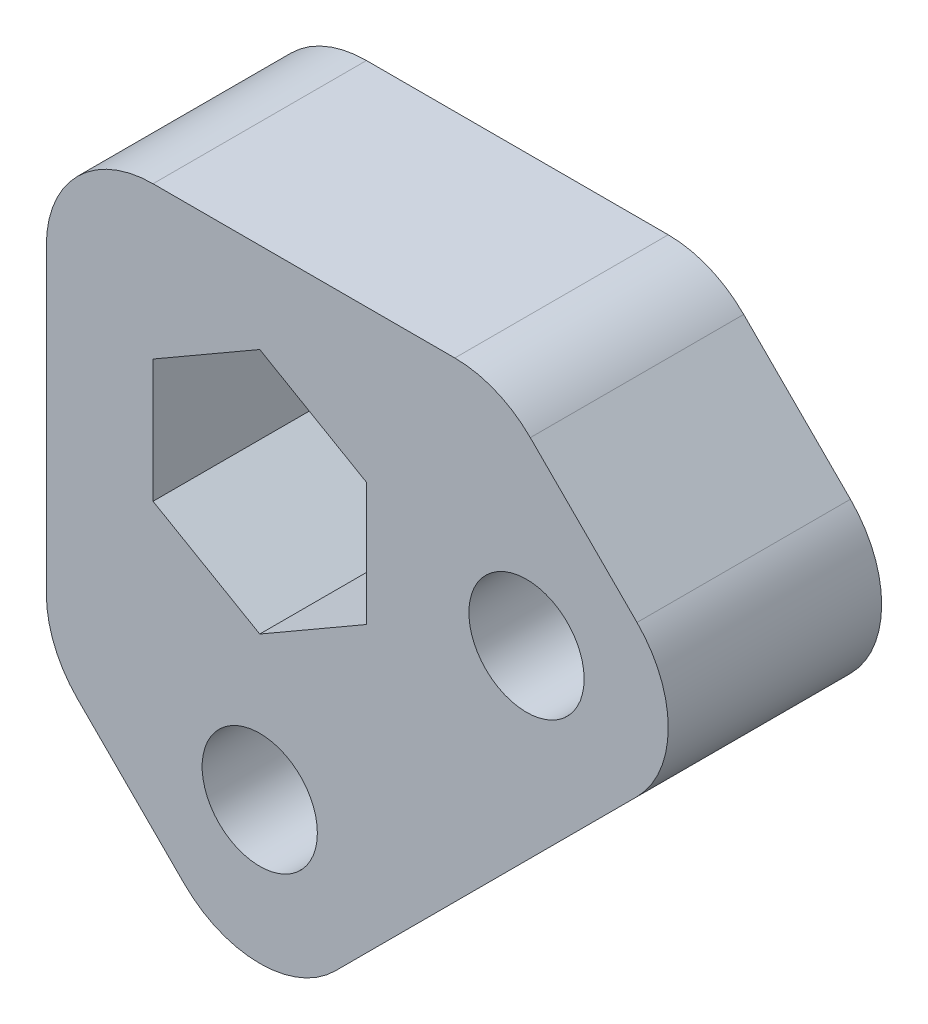
ISO-10303-21;
HEADER;
FILE_DESCRIPTION(('STEP AP214'),'2;1');
FILE_NAME('part.step','',(''),(''),'','','');
FILE_SCHEMA(('AUTOMOTIVE_DESIGN { 1 0 10303 214 1 1 1 1 }'));
ENDSEC;
DATA;
#1=APPLICATION_CONTEXT('core data for automotive mechanical design processes');
#2=APPLICATION_PROTOCOL_DEFINITION('international standard','automotive_design',2000,#1);
#3=PRODUCT_CONTEXT('',#1,'mechanical');
#4=PRODUCT('Part','Part','',(#3));
#5=PRODUCT_RELATED_PRODUCT_CATEGORY('part','',(#4));
#6=PRODUCT_DEFINITION_FORMATION('','',#4);
#7=PRODUCT_DEFINITION_CONTEXT('part definition',#1,'design');
#8=PRODUCT_DEFINITION('design','',#6,#7);
#9=PRODUCT_DEFINITION_SHAPE('','',#8);
#10=(LENGTH_UNIT() NAMED_UNIT(*) SI_UNIT(.MILLI.,.METRE.));
#11=(NAMED_UNIT(*) PLANE_ANGLE_UNIT() SI_UNIT($,.RADIAN.));
#12=(NAMED_UNIT(*) SI_UNIT($,.STERADIAN.) SOLID_ANGLE_UNIT());
#13=UNCERTAINTY_MEASURE_WITH_UNIT(LENGTH_MEASURE(1.E-05),#10,'distance_accuracy_value','');
#14=(GEOMETRIC_REPRESENTATION_CONTEXT(3) GLOBAL_UNCERTAINTY_ASSIGNED_CONTEXT((#13)) GLOBAL_UNIT_ASSIGNED_CONTEXT((#10,
#11,#12)) REPRESENTATION_CONTEXT('',''));
#15=CARTESIAN_POINT('',(0.,0.,0.));
#16=DIRECTION('',(0.,0.,1.));
#17=DIRECTION('',(1.,0.,0.));
#18=AXIS2_PLACEMENT_3D('',#15,#16,#17);
#19=CARTESIAN_POINT('',(-6.35,-11.6105122421383,12.7));
#20=DIRECTION('',(0.,0.,1.));
#21=DIRECTION('',(1.,0.,0.));
#22=AXIS2_PLACEMENT_3D('',#19,#20,#21);
#23=PLANE('',#22);
#24=CARTESIAN_POINT('',(15.8750000000004,0.,12.7));
#25=DIRECTION('',(0.,0.,1.));
#26=DIRECTION('',(1.,0.,0.));
#27=AXIS2_PLACEMENT_3D('',#24,#25,#26);
#28=CIRCLE('',#27,3.429);
#29=CARTESIAN_POINT('',(19.3040000000004,0.,12.7));
#30=VERTEX_POINT('',#29);
#31=EDGE_CURVE('E201',#30,#30,#28,.T.);
#32=ORIENTED_EDGE('',*,*,#31,.F.);
#33=EDGE_LOOP('',(#32));
#34=FACE_BOUND('',#33,.T.);
#35=CARTESIAN_POINT('',(-6.35,-11.6105122421383,12.7));
#36=DIRECTION('',(0.,0.,1.));
#37=DIRECTION('',(1.,0.,0.));
#38=AXIS2_PLACEMENT_3D('',#35,#36,#37);
#39=CIRCLE('',#38,6.35);
#40=CARTESIAN_POINT('',(-12.7,-11.6105122421383,12.7));
#41=VERTEX_POINT('',#40);
#42=CARTESIAN_POINT('',(-10.8401280605346,-16.1006403026729,12.7));
#43=VERTEX_POINT('',#42);
#44=EDGE_CURVE('E231',#41,#43,#39,.T.);
#45=ORIENTED_EDGE('',*,*,#44,.T.);
#46=DIRECTION('',(0.707106781186547,-0.707106781186549,0.));
#47=VECTOR('',#46,1.);
#48=CARTESIAN_POINT('',(-10.8401280605346,-16.1006403026729,12.7));
#49=LINE('',#48,#47);
#50=CARTESIAN_POINT('',(-4.49012806053461,-22.4506403026729,12.7));
#51=VERTEX_POINT('',#50);
#52=EDGE_CURVE('E235',#43,#51,#49,.T.);
#53=ORIENTED_EDGE('',*,*,#52,.T.);
#54=CARTESIAN_POINT('',(0.,-17.9605122421383,12.7));
#55=DIRECTION('',(0.,0.,1.));
#56=DIRECTION('',(1.,0.,0.));
#57=AXIS2_PLACEMENT_3D('',#54,#55,#56);
#58=CIRCLE('',#57,6.35);
#59=CARTESIAN_POINT('',(4.49012806053461,-22.4506403026729,12.7));
#60=VERTEX_POINT('',#59);
#61=EDGE_CURVE('E239',#51,#60,#58,.T.);
#62=ORIENTED_EDGE('',*,*,#61,.T.);
#63=DIRECTION('',(0.707106781186547,0.707106781186547,0.));
#64=VECTOR('',#63,1.);
#65=CARTESIAN_POINT('',(4.49012806053461,-22.4506403026729,12.7));
#66=LINE('',#65,#64);
#67=CARTESIAN_POINT('',(22.4506403026729,-4.49012806053461,12.7));
#68=VERTEX_POINT('',#67);
#69=EDGE_CURVE('E242',#60,#68,#66,.T.);
#70=ORIENTED_EDGE('',*,*,#69,.T.);
#71=CARTESIAN_POINT('',(17.9605122421383,0.,12.7));
#72=DIRECTION('',(0.,0.,1.));
#73=DIRECTION('',(1.,0.,0.));
#74=AXIS2_PLACEMENT_3D('',#71,#72,#73);
#75=CIRCLE('',#74,6.35);
#76=CARTESIAN_POINT('',(22.4506403026729,4.49012806053461,12.7));
#77=VERTEX_POINT('',#76);
#78=EDGE_CURVE('E245',#68,#77,#75,.T.);
#79=ORIENTED_EDGE('',*,*,#78,.T.);
#80=DIRECTION('',(-0.707106781186548,0.707106781186547,0.));
#81=VECTOR('',#80,1.);
#82=CARTESIAN_POINT('',(22.4506403026729,4.49012806053461,12.7));
#83=LINE('',#82,#81);
#84=CARTESIAN_POINT('',(16.1006403026729,10.8401280605346,12.7));
#85=VERTEX_POINT('',#84);
#86=EDGE_CURVE('E248',#77,#85,#83,.T.);
#87=ORIENTED_EDGE('',*,*,#86,.T.);
#88=CARTESIAN_POINT('',(11.6105122421383,6.35,12.7));
#89=DIRECTION('',(0.,0.,1.));
#90=DIRECTION('',(-1.,0.,0.));
#91=AXIS2_PLACEMENT_3D('',#88,#89,#90);
#92=CIRCLE('',#91,6.35);
#93=CARTESIAN_POINT('',(11.6105122421383,12.7,12.7));
#94=VERTEX_POINT('',#93);
#95=EDGE_CURVE('E251',#85,#94,#92,.T.);
#96=ORIENTED_EDGE('',*,*,#95,.T.);
#97=DIRECTION('',(-1.,0.,0.));
#98=VECTOR('',#97,1.);
#99=CARTESIAN_POINT('',(-6.34999999999996,12.7,12.7));
#100=LINE('',#99,#98);
#101=CARTESIAN_POINT('',(-6.34999999999996,12.7,12.7));
#102=VERTEX_POINT('',#101);
#103=EDGE_CURVE('E254',#94,#102,#100,.T.);
#104=ORIENTED_EDGE('',*,*,#103,.T.);
#105=CARTESIAN_POINT('',(-6.35,6.35,12.7));
#106=DIRECTION('',(0.,0.,1.));
#107=DIRECTION('',(-1.,0.,0.));
#108=AXIS2_PLACEMENT_3D('',#105,#106,#107);
#109=CIRCLE('',#108,6.35);
#110=CARTESIAN_POINT('',(-12.7,6.34999999999995,12.7));
#111=VERTEX_POINT('',#110);
#112=EDGE_CURVE('E257',#102,#111,#109,.T.);
#113=ORIENTED_EDGE('',*,*,#112,.T.);
#114=DIRECTION('',(0.,-1.,0.));
#115=VECTOR('',#114,1.);
#116=CARTESIAN_POINT('',(-12.7,6.34999999999995,12.7));
#117=LINE('',#116,#115);
#118=EDGE_CURVE('E260',#111,#41,#117,.T.);
#119=ORIENTED_EDGE('',*,*,#118,.T.);
#120=EDGE_LOOP('',(#45,#53,#62,#70,#79,#87,#96,#104,#113,#119));
#121=FACE_BOUND('',#120,.T.);
#122=DIRECTION('',(-0.866025403784438,0.5,0.));
#123=VECTOR('',#122,1.);
#124=CARTESIAN_POINT('',(6.35,3.66617420935412,12.7));
#125=LINE('',#124,#123);
#126=CARTESIAN_POINT('',(6.35,3.66617420935412,12.7));
#127=VERTEX_POINT('',#126);
#128=CARTESIAN_POINT('',(0.,7.33234841870825,12.7));
#129=VERTEX_POINT('',#128);
#130=EDGE_CURVE('E168',#127,#129,#125,.T.);
#131=ORIENTED_EDGE('',*,*,#130,.F.);
#132=DIRECTION('',(0.,1.,0.));
#133=VECTOR('',#132,1.);
#134=CARTESIAN_POINT('',(6.35,-3.66617420935413,12.7));
#135=LINE('',#134,#133);
#136=CARTESIAN_POINT('',(6.35,-3.66617420935413,12.7));
#137=VERTEX_POINT('',#136);
#138=EDGE_CURVE('E159',#137,#127,#135,.T.);
#139=ORIENTED_EDGE('',*,*,#138,.F.);
#140=DIRECTION('',(0.866025403784439,0.5,0.));
#141=VECTOR('',#140,1.);
#142=CARTESIAN_POINT('',(0.,-7.33234841870825,12.7));
#143=LINE('',#142,#141);
#144=CARTESIAN_POINT('',(0.,-7.33234841870825,12.7));
#145=VERTEX_POINT('',#144);
#146=EDGE_CURVE('E196',#145,#137,#143,.T.);
#147=ORIENTED_EDGE('',*,*,#146,.F.);
#148=DIRECTION('',(0.866025403784439,-0.5,0.));
#149=VECTOR('',#148,1.);
#150=CARTESIAN_POINT('',(-6.35,-3.66617420935412,12.7));
#151=LINE('',#150,#149);
#152=CARTESIAN_POINT('',(-6.35,-3.66617420935412,12.7));
#153=VERTEX_POINT('',#152);
#154=EDGE_CURVE('E193',#153,#145,#151,.T.);
#155=ORIENTED_EDGE('',*,*,#154,.F.);
#156=DIRECTION('',(0.,-1.,0.));
#157=VECTOR('',#156,1.);
#158=CARTESIAN_POINT('',(-6.35,3.66617420935413,12.7));
#159=LINE('',#158,#157);
#160=CARTESIAN_POINT('',(-6.35,3.66617420935413,12.7));
#161=VERTEX_POINT('',#160);
#162=EDGE_CURVE('E187',#161,#153,#159,.T.);
#163=ORIENTED_EDGE('',*,*,#162,.F.);
#164=DIRECTION('',(-0.866025403784439,-0.5,0.));
#165=VECTOR('',#164,1.);
#166=CARTESIAN_POINT('',(0.,7.33234841870825,12.7));
#167=LINE('',#166,#165);
#168=EDGE_CURVE('E183',#129,#161,#167,.T.);
#169=ORIENTED_EDGE('',*,*,#168,.F.);
#170=EDGE_LOOP('',(#131,#139,#147,#155,#163,#169));
#171=FACE_BOUND('',#170,.T.);
#172=CARTESIAN_POINT('',(0.,-15.8750000000004,12.7));
#173=DIRECTION('',(0.,0.,1.));
#174=DIRECTION('',(1.,0.,0.));
#175=AXIS2_PLACEMENT_3D('',#172,#173,#174);
#176=CIRCLE('',#175,3.42900000000011);
#177=CARTESIAN_POINT('',(3.42900000000011,-15.8750000000004,12.7));
#178=VERTEX_POINT('',#177);
#179=EDGE_CURVE('E590',#178,#178,#176,.T.);
#180=ORIENTED_EDGE('',*,*,#179,.F.);
#181=EDGE_LOOP('',(#180));
#182=FACE_BOUND('',#181,.T.);
#183=ADVANCED_FACE('F45',(#34,#121,#171,#182),#23,.T.);
#184=CARTESIAN_POINT('',(-6.35,-11.6105122421383,0.));
#185=DIRECTION('',(0.,0.,1.));
#186=DIRECTION('',(1.,0.,0.));
#187=AXIS2_PLACEMENT_3D('',#184,#185,#186);
#188=PLANE('',#187);
#189=CARTESIAN_POINT('',(-6.35,-11.6105122421383,0.));
#190=DIRECTION('',(0.,0.,1.));
#191=DIRECTION('',(1.,0.,0.));
#192=AXIS2_PLACEMENT_3D('',#189,#190,#191);
#193=CIRCLE('',#192,6.35);
#194=CARTESIAN_POINT('',(-12.7,-11.6105122421383,0.));
#195=VERTEX_POINT('',#194);
#196=CARTESIAN_POINT('',(-10.8401280605346,-16.1006403026729,0.));
#197=VERTEX_POINT('',#196);
#198=EDGE_CURVE('E177',#195,#197,#193,.T.);
#199=ORIENTED_EDGE('',*,*,#198,.F.);
#200=DIRECTION('',(0.,-1.,0.));
#201=VECTOR('',#200,1.);
#202=CARTESIAN_POINT('',(-12.7,6.34999999999995,0.));
#203=LINE('',#202,#201);
#204=CARTESIAN_POINT('',(-12.7,6.34999999999995,0.));
#205=VERTEX_POINT('',#204);
#206=EDGE_CURVE('E236',#205,#195,#203,.T.);
#207=ORIENTED_EDGE('',*,*,#206,.F.);
#208=CARTESIAN_POINT('',(-6.35,6.35,0.));
#209=DIRECTION('',(0.,0.,1.));
#210=DIRECTION('',(-1.,0.,0.));
#211=AXIS2_PLACEMENT_3D('',#208,#209,#210);
#212=CIRCLE('',#211,6.35);
#213=CARTESIAN_POINT('',(-6.34999999999996,12.7,0.));
#214=VERTEX_POINT('',#213);
#215=EDGE_CURVE('E288',#214,#205,#212,.T.);
#216=ORIENTED_EDGE('',*,*,#215,.F.);
#217=DIRECTION('',(-1.,0.,0.));
#218=VECTOR('',#217,1.);
#219=CARTESIAN_POINT('',(-6.34999999999996,12.7,0.));
#220=LINE('',#219,#218);
#221=CARTESIAN_POINT('',(11.6105122421383,12.7,0.));
#222=VERTEX_POINT('',#221);
#223=EDGE_CURVE('E285',#222,#214,#220,.T.);
#224=ORIENTED_EDGE('',*,*,#223,.F.);
#225=CARTESIAN_POINT('',(11.6105122421383,6.35,0.));
#226=DIRECTION('',(0.,0.,1.));
#227=DIRECTION('',(-1.,0.,0.));
#228=AXIS2_PLACEMENT_3D('',#225,#226,#227);
#229=CIRCLE('',#228,6.35);
#230=CARTESIAN_POINT('',(16.1006403026729,10.8401280605346,0.));
#231=VERTEX_POINT('',#230);
#232=EDGE_CURVE('E282',#231,#222,#229,.T.);
#233=ORIENTED_EDGE('',*,*,#232,.F.);
#234=DIRECTION('',(-0.707106781186548,0.707106781186547,0.));
#235=VECTOR('',#234,1.);
#236=CARTESIAN_POINT('',(22.4506403026729,4.49012806053461,0.));
#237=LINE('',#236,#235);
#238=CARTESIAN_POINT('',(22.4506403026729,4.49012806053461,0.));
#239=VERTEX_POINT('',#238);
#240=EDGE_CURVE('E279',#239,#231,#237,.T.);
#241=ORIENTED_EDGE('',*,*,#240,.F.);
#242=CARTESIAN_POINT('',(17.9605122421383,0.,0.));
#243=DIRECTION('',(0.,0.,1.));
#244=DIRECTION('',(1.,0.,0.));
#245=AXIS2_PLACEMENT_3D('',#242,#243,#244);
#246=CIRCLE('',#245,6.35);
#247=CARTESIAN_POINT('',(22.4506403026729,-4.49012806053461,0.));
#248=VERTEX_POINT('',#247);
#249=EDGE_CURVE('E276',#248,#239,#246,.T.);
#250=ORIENTED_EDGE('',*,*,#249,.F.);
#251=DIRECTION('',(0.707106781186547,0.707106781186547,0.));
#252=VECTOR('',#251,1.);
#253=CARTESIAN_POINT('',(4.49012806053461,-22.4506403026729,0.));
#254=LINE('',#253,#252);
#255=CARTESIAN_POINT('',(4.49012806053461,-22.4506403026729,0.));
#256=VERTEX_POINT('',#255);
#257=EDGE_CURVE('E273',#256,#248,#254,.T.);
#258=ORIENTED_EDGE('',*,*,#257,.F.);
#259=CARTESIAN_POINT('',(0.,-17.9605122421383,0.));
#260=DIRECTION('',(0.,0.,1.));
#261=DIRECTION('',(1.,0.,0.));
#262=AXIS2_PLACEMENT_3D('',#259,#260,#261);
#263=CIRCLE('',#262,6.35);
#264=CARTESIAN_POINT('',(-4.49012806053461,-22.4506403026729,0.));
#265=VERTEX_POINT('',#264);
#266=EDGE_CURVE('E270',#265,#256,#263,.T.);
#267=ORIENTED_EDGE('',*,*,#266,.F.);
#268=DIRECTION('',(0.707106781186547,-0.707106781186549,0.));
#269=VECTOR('',#268,1.);
#270=CARTESIAN_POINT('',(-10.8401280605346,-16.1006403026729,0.));
#271=LINE('',#270,#269);
#272=EDGE_CURVE('E267',#197,#265,#271,.T.);
#273=ORIENTED_EDGE('',*,*,#272,.F.);
#274=EDGE_LOOP('',(#199,#207,#216,#224,#233,#241,#250,#258,#267,#273));
#275=FACE_BOUND('',#274,.T.);
#276=DIRECTION('',(0.,1.,0.));
#277=VECTOR('',#276,1.);
#278=CARTESIAN_POINT('',(6.35,-3.66617420935413,0.));
#279=LINE('',#278,#277);
#280=CARTESIAN_POINT('',(6.35,-3.66617420935413,0.));
#281=VERTEX_POINT('',#280);
#282=CARTESIAN_POINT('',(6.35,3.66617420935412,0.));
#283=VERTEX_POINT('',#282);
#284=EDGE_CURVE('E69',#281,#283,#279,.T.);
#285=ORIENTED_EDGE('',*,*,#284,.T.);
#286=DIRECTION('',(-0.866025403784438,0.5,0.));
#287=VECTOR('',#286,1.);
#288=CARTESIAN_POINT('',(6.35,3.66617420935412,0.));
#289=LINE('',#288,#287);
#290=CARTESIAN_POINT('',(0.,7.33234841870825,0.));
#291=VERTEX_POINT('',#290);
#292=EDGE_CURVE('E175',#283,#291,#289,.T.);
#293=ORIENTED_EDGE('',*,*,#292,.T.);
#294=DIRECTION('',(-0.866025403784439,-0.5,0.));
#295=VECTOR('',#294,1.);
#296=CARTESIAN_POINT('',(0.,7.33234841870825,0.));
#297=LINE('',#296,#295);
#298=CARTESIAN_POINT('',(-6.35,3.66617420935413,0.));
#299=VERTEX_POINT('',#298);
#300=EDGE_CURVE('E204',#291,#299,#297,.T.);
#301=ORIENTED_EDGE('',*,*,#300,.T.);
#302=DIRECTION('',(0.,-1.,0.));
#303=VECTOR('',#302,1.);
#304=CARTESIAN_POINT('',(-6.35,3.66617420935413,0.));
#305=LINE('',#304,#303);
#306=CARTESIAN_POINT('',(-6.35,-3.66617420935412,0.));
#307=VERTEX_POINT('',#306);
#308=EDGE_CURVE('E208',#299,#307,#305,.T.);
#309=ORIENTED_EDGE('',*,*,#308,.T.);
#310=DIRECTION('',(0.866025403784439,-0.5,0.));
#311=VECTOR('',#310,1.);
#312=CARTESIAN_POINT('',(-6.35,-3.66617420935412,0.));
#313=LINE('',#312,#311);
#314=CARTESIAN_POINT('',(0.,-7.33234841870825,0.));
#315=VERTEX_POINT('',#314);
#316=EDGE_CURVE('E212',#307,#315,#313,.T.);
#317=ORIENTED_EDGE('',*,*,#316,.T.);
#318=DIRECTION('',(0.866025403784439,0.5,0.));
#319=VECTOR('',#318,1.);
#320=CARTESIAN_POINT('',(0.,-7.33234841870825,0.));
#321=LINE('',#320,#319);
#322=EDGE_CURVE('E169',#315,#281,#321,.T.);
#323=ORIENTED_EDGE('',*,*,#322,.T.);
#324=EDGE_LOOP('',(#285,#293,#301,#309,#317,#323));
#325=FACE_BOUND('',#324,.T.);
#326=CARTESIAN_POINT('',(15.8750000000004,0.,0.));
#327=DIRECTION('',(0.,0.,1.));
#328=DIRECTION('',(1.,0.,0.));
#329=AXIS2_PLACEMENT_3D('',#326,#327,#328);
#330=CIRCLE('',#329,3.429);
#331=CARTESIAN_POINT('',(19.3040000000004,0.,0.));
#332=VERTEX_POINT('',#331);
#333=EDGE_CURVE('E598',#332,#332,#330,.T.);
#334=ORIENTED_EDGE('',*,*,#333,.T.);
#335=EDGE_LOOP('',(#334));
#336=FACE_BOUND('',#335,.T.);
#337=CARTESIAN_POINT('',(0.,-15.8750000000004,0.));
#338=DIRECTION('',(0.,0.,1.));
#339=DIRECTION('',(1.,0.,0.));
#340=AXIS2_PLACEMENT_3D('',#337,#338,#339);
#341=CIRCLE('',#340,3.42900000000011);
#342=CARTESIAN_POINT('',(3.42900000000011,-15.8750000000004,0.));
#343=VERTEX_POINT('',#342);
#344=EDGE_CURVE('E593',#343,#343,#341,.T.);
#345=ORIENTED_EDGE('',*,*,#344,.T.);
#346=EDGE_LOOP('',(#345));
#347=FACE_BOUND('',#346,.T.);
#348=ADVANCED_FACE('F335',(#275,#325,#336,#347),#188,.F.);
#349=CARTESIAN_POINT('',(-6.35,-11.6105122421383,12.7));
#350=DIRECTION('',(0.,0.,-1.));
#351=DIRECTION('',(-1.,0.,0.));
#352=AXIS2_PLACEMENT_3D('',#349,#350,#351);
#353=CYLINDRICAL_SURFACE('',#352,6.35);
#354=ORIENTED_EDGE('',*,*,#198,.T.);
#355=DIRECTION('',(0.,0.,-1.));
#356=VECTOR('',#355,1.);
#357=CARTESIAN_POINT('',(-10.8401280605346,-16.1006403026729,12.7));
#358=LINE('',#357,#356);
#359=EDGE_CURVE('E11',#43,#197,#358,.T.);
#360=ORIENTED_EDGE('',*,*,#359,.F.);
#361=ORIENTED_EDGE('',*,*,#44,.F.);
#362=DIRECTION('',(0.,0.,-1.));
#363=VECTOR('',#362,1.);
#364=CARTESIAN_POINT('',(-12.7,-11.6105122421383,12.7));
#365=LINE('',#364,#363);
#366=EDGE_CURVE('E263',#41,#195,#365,.T.);
#367=ORIENTED_EDGE('',*,*,#366,.T.);
#368=EDGE_LOOP('',(#354,#360,#361,#367));
#369=FACE_BOUND('',#368,.T.);
#370=ADVANCED_FACE('F47',(#369),#353,.T.);
#371=CARTESIAN_POINT('',(-10.8401280605346,-16.1006403026729,12.7));
#372=DIRECTION('',(0.707106781186549,0.707106781186546,0.));
#373=DIRECTION('',(-0.707106781186546,0.707106781186549,0.));
#374=AXIS2_PLACEMENT_3D('',#371,#372,#373);
#375=PLANE('',#374);
#376=ORIENTED_EDGE('',*,*,#272,.T.);
#377=DIRECTION('',(0.,0.,-1.));
#378=VECTOR('',#377,1.);
#379=CARTESIAN_POINT('',(-4.49012806053461,-22.4506403026729,12.7));
#380=LINE('',#379,#378);
#381=EDGE_CURVE('E54',#51,#265,#380,.T.);
#382=ORIENTED_EDGE('',*,*,#381,.F.);
#383=ORIENTED_EDGE('',*,*,#52,.F.);
#384=ORIENTED_EDGE('',*,*,#359,.T.);
#385=EDGE_LOOP('',(#376,#382,#383,#384));
#386=FACE_BOUND('',#385,.T.);
#387=ADVANCED_FACE('F352',(#386),#375,.F.);
#388=CARTESIAN_POINT('',(0.,-17.9605122421383,12.7));
#389=DIRECTION('',(0.,0.,-1.));
#390=DIRECTION('',(-1.,0.,0.));
#391=AXIS2_PLACEMENT_3D('',#388,#389,#390);
#392=CYLINDRICAL_SURFACE('',#391,6.35);
#393=ORIENTED_EDGE('',*,*,#266,.T.);
#394=DIRECTION('',(0.,0.,-1.));
#395=VECTOR('',#394,1.);
#396=CARTESIAN_POINT('',(4.49012806053461,-22.4506403026729,12.7));
#397=LINE('',#396,#395);
#398=EDGE_CURVE('E320',#60,#256,#397,.T.);
#399=ORIENTED_EDGE('',*,*,#398,.F.);
#400=ORIENTED_EDGE('',*,*,#61,.F.);
#401=ORIENTED_EDGE('',*,*,#381,.T.);
#402=EDGE_LOOP('',(#393,#399,#400,#401));
#403=FACE_BOUND('',#402,.T.);
#404=ADVANCED_FACE('F329',(#403),#392,.T.);
#405=CARTESIAN_POINT('',(4.49012806053461,-22.4506403026729,12.7));
#406=DIRECTION('',(-0.707106781186548,0.707106781186548,0.));
#407=DIRECTION('',(-0.707106781186548,-0.707106781186548,0.));
#408=AXIS2_PLACEMENT_3D('',#405,#406,#407);
#409=PLANE('',#408);
#410=ORIENTED_EDGE('',*,*,#257,.T.);
#411=DIRECTION('',(0.,0.,-1.));
#412=VECTOR('',#411,1.);
#413=CARTESIAN_POINT('',(22.4506403026729,-4.49012806053461,12.7));
#414=LINE('',#413,#412);
#415=EDGE_CURVE('E316',#68,#248,#414,.T.);
#416=ORIENTED_EDGE('',*,*,#415,.F.);
#417=ORIENTED_EDGE('',*,*,#69,.F.);
#418=ORIENTED_EDGE('',*,*,#398,.T.);
#419=EDGE_LOOP('',(#410,#416,#417,#418));
#420=FACE_BOUND('',#419,.T.);
#421=ADVANCED_FACE('F341',(#420),#409,.F.);
#422=CARTESIAN_POINT('',(17.9605122421383,0.,12.7));
#423=DIRECTION('',(0.,0.,-1.));
#424=DIRECTION('',(-1.,0.,0.));
#425=AXIS2_PLACEMENT_3D('',#422,#423,#424);
#426=CYLINDRICAL_SURFACE('',#425,6.35);
#427=ORIENTED_EDGE('',*,*,#249,.T.);
#428=DIRECTION('',(0.,0.,-1.));
#429=VECTOR('',#428,1.);
#430=CARTESIAN_POINT('',(22.4506403026729,4.49012806053461,12.7));
#431=LINE('',#430,#429);
#432=EDGE_CURVE('E312',#77,#239,#431,.T.);
#433=ORIENTED_EDGE('',*,*,#432,.F.);
#434=ORIENTED_EDGE('',*,*,#78,.F.);
#435=ORIENTED_EDGE('',*,*,#415,.T.);
#436=EDGE_LOOP('',(#427,#433,#434,#435));
#437=FACE_BOUND('',#436,.T.);
#438=ADVANCED_FACE('F345',(#437),#426,.T.);
#439=CARTESIAN_POINT('',(22.4506403026729,4.49012806053461,12.7));
#440=DIRECTION('',(-0.707106781186547,-0.707106781186548,0.));
#441=DIRECTION('',(0.707106781186548,-0.707106781186547,0.));
#442=AXIS2_PLACEMENT_3D('',#439,#440,#441);
#443=PLANE('',#442);
#444=ORIENTED_EDGE('',*,*,#240,.T.);
#445=DIRECTION('',(0.,0.,-1.));
#446=VECTOR('',#445,1.);
#447=CARTESIAN_POINT('',(16.1006403026729,10.8401280605346,12.7));
#448=LINE('',#447,#446);
#449=EDGE_CURVE('E308',#85,#231,#448,.T.);
#450=ORIENTED_EDGE('',*,*,#449,.F.);
#451=ORIENTED_EDGE('',*,*,#86,.F.);
#452=ORIENTED_EDGE('',*,*,#432,.T.);
#453=EDGE_LOOP('',(#444,#450,#451,#452));
#454=FACE_BOUND('',#453,.T.);
#455=ADVANCED_FACE('F375',(#454),#443,.F.);
#456=CARTESIAN_POINT('',(11.6105122421383,6.35,12.7));
#457=DIRECTION('',(0.,0.,-1.));
#458=DIRECTION('',(-1.,0.,0.));
#459=AXIS2_PLACEMENT_3D('',#456,#457,#458);
#460=CYLINDRICAL_SURFACE('',#459,6.35);
#461=ORIENTED_EDGE('',*,*,#232,.T.);
#462=DIRECTION('',(0.,0.,-1.));
#463=VECTOR('',#462,1.);
#464=CARTESIAN_POINT('',(11.6105122421383,12.7,12.7));
#465=LINE('',#464,#463);
#466=EDGE_CURVE('E304',#94,#222,#465,.T.);
#467=ORIENTED_EDGE('',*,*,#466,.F.);
#468=ORIENTED_EDGE('',*,*,#95,.F.);
#469=ORIENTED_EDGE('',*,*,#449,.T.);
#470=EDGE_LOOP('',(#461,#467,#468,#469));
#471=FACE_BOUND('',#470,.T.);
#472=ADVANCED_FACE('F372',(#471),#460,.T.);
#473=CARTESIAN_POINT('',(-6.34999999999996,12.7,12.7));
#474=DIRECTION('',(0.,-1.,0.));
#475=DIRECTION('',(0.,0.,-1.));
#476=AXIS2_PLACEMENT_3D('',#473,#474,#475);
#477=PLANE('',#476);
#478=ORIENTED_EDGE('',*,*,#223,.T.);
#479=DIRECTION('',(0.,0.,-1.));
#480=VECTOR('',#479,1.);
#481=CARTESIAN_POINT('',(-6.34999999999996,12.7,12.7));
#482=LINE('',#481,#480);
#483=EDGE_CURVE('E300',#102,#214,#482,.T.);
#484=ORIENTED_EDGE('',*,*,#483,.F.);
#485=ORIENTED_EDGE('',*,*,#103,.F.);
#486=ORIENTED_EDGE('',*,*,#466,.T.);
#487=EDGE_LOOP('',(#478,#484,#485,#486));
#488=FACE_BOUND('',#487,.T.);
#489=ADVANCED_FACE('F368',(#488),#477,.F.);
#490=CARTESIAN_POINT('',(-6.35,6.35,12.7));
#491=DIRECTION('',(0.,0.,-1.));
#492=DIRECTION('',(-1.,0.,0.));
#493=AXIS2_PLACEMENT_3D('',#490,#491,#492);
#494=CYLINDRICAL_SURFACE('',#493,6.35);
#495=ORIENTED_EDGE('',*,*,#215,.T.);
#496=DIRECTION('',(0.,0.,-1.));
#497=VECTOR('',#496,1.);
#498=CARTESIAN_POINT('',(-12.7,6.34999999999995,12.7));
#499=LINE('',#498,#497);
#500=EDGE_CURVE('E296',#111,#205,#499,.T.);
#501=ORIENTED_EDGE('',*,*,#500,.F.);
#502=ORIENTED_EDGE('',*,*,#112,.F.);
#503=ORIENTED_EDGE('',*,*,#483,.T.);
#504=EDGE_LOOP('',(#495,#501,#502,#503));
#505=FACE_BOUND('',#504,.T.);
#506=ADVANCED_FACE('F364',(#505),#494,.T.);
#507=CARTESIAN_POINT('',(-12.7,6.34999999999995,12.7));
#508=DIRECTION('',(1.,0.,0.));
#509=DIRECTION('',(0.,1.,0.));
#510=AXIS2_PLACEMENT_3D('',#507,#508,#509);
#511=PLANE('',#510);
#512=ORIENTED_EDGE('',*,*,#206,.T.);
#513=ORIENTED_EDGE('',*,*,#366,.F.);
#514=ORIENTED_EDGE('',*,*,#118,.F.);
#515=ORIENTED_EDGE('',*,*,#500,.T.);
#516=EDGE_LOOP('',(#512,#513,#514,#515));
#517=FACE_BOUND('',#516,.T.);
#518=ADVANCED_FACE('F359',(#517),#511,.F.);
#519=CARTESIAN_POINT('',(6.35,-3.66617420935413,12.7));
#520=DIRECTION('',(-1.,0.,0.));
#521=DIRECTION('',(0.,-1.,0.));
#522=AXIS2_PLACEMENT_3D('',#519,#520,#521);
#523=PLANE('',#522);
#524=ORIENTED_EDGE('',*,*,#284,.F.);
#525=DIRECTION('',(0.,0.,-1.));
#526=VECTOR('',#525,1.);
#527=CARTESIAN_POINT('',(6.35,-3.66617420935413,12.7));
#528=LINE('',#527,#526);
#529=EDGE_CURVE('E163',#137,#281,#528,.T.);
#530=ORIENTED_EDGE('',*,*,#529,.F.);
#531=ORIENTED_EDGE('',*,*,#138,.T.);
#532=DIRECTION('',(0.,0.,-1.));
#533=VECTOR('',#532,1.);
#534=CARTESIAN_POINT('',(6.35,3.66617420935412,12.7));
#535=LINE('',#534,#533);
#536=EDGE_CURVE('E162',#127,#283,#535,.T.);
#537=ORIENTED_EDGE('',*,*,#536,.T.);
#538=EDGE_LOOP('',(#524,#530,#531,#537));
#539=FACE_BOUND('',#538,.T.);
#540=ADVANCED_FACE('F161',(#539),#523,.T.);
#541=CARTESIAN_POINT('',(6.35,3.66617420935412,12.7));
#542=DIRECTION('',(-0.5,-0.866025403784438,0.));
#543=DIRECTION('',(0.866025403784438,-0.5,0.));
#544=AXIS2_PLACEMENT_3D('',#541,#542,#543);
#545=PLANE('',#544);
#546=ORIENTED_EDGE('',*,*,#292,.F.);
#547=ORIENTED_EDGE('',*,*,#536,.F.);
#548=ORIENTED_EDGE('',*,*,#130,.T.);
#549=DIRECTION('',(0.,0.,-1.));
#550=VECTOR('',#549,1.);
#551=CARTESIAN_POINT('',(0.,7.33234841870825,12.7));
#552=LINE('',#551,#550);
#553=EDGE_CURVE('E178',#129,#291,#552,.T.);
#554=ORIENTED_EDGE('',*,*,#553,.T.);
#555=EDGE_LOOP('',(#546,#547,#548,#554));
#556=FACE_BOUND('',#555,.T.);
#557=ADVANCED_FACE('F172',(#556),#545,.T.);
#558=CARTESIAN_POINT('',(0.,7.33234841870825,12.7));
#559=DIRECTION('',(0.5,-0.866025403784439,0.));
#560=DIRECTION('',(0.866025403784439,0.5,0.));
#561=AXIS2_PLACEMENT_3D('',#558,#559,#560);
#562=PLANE('',#561);
#563=ORIENTED_EDGE('',*,*,#300,.F.);
#564=ORIENTED_EDGE('',*,*,#553,.F.);
#565=ORIENTED_EDGE('',*,*,#168,.T.);
#566=DIRECTION('',(0.,0.,-1.));
#567=VECTOR('',#566,1.);
#568=CARTESIAN_POINT('',(-6.35,3.66617420935413,12.7));
#569=LINE('',#568,#567);
#570=EDGE_CURVE('E226',#161,#299,#569,.T.);
#571=ORIENTED_EDGE('',*,*,#570,.T.);
#572=EDGE_LOOP('',(#563,#564,#565,#571));
#573=FACE_BOUND('',#572,.T.);
#574=ADVANCED_FACE('F423',(#573),#562,.T.);
#575=CARTESIAN_POINT('',(-6.35,3.66617420935413,12.7));
#576=DIRECTION('',(1.,0.,0.));
#577=DIRECTION('',(0.,1.,0.));
#578=AXIS2_PLACEMENT_3D('',#575,#576,#577);
#579=PLANE('',#578);
#580=ORIENTED_EDGE('',*,*,#308,.F.);
#581=ORIENTED_EDGE('',*,*,#570,.F.);
#582=ORIENTED_EDGE('',*,*,#162,.T.);
#583=DIRECTION('',(0.,0.,-1.));
#584=VECTOR('',#583,1.);
#585=CARTESIAN_POINT('',(-6.35,-3.66617420935412,12.7));
#586=LINE('',#585,#584);
#587=EDGE_CURVE('E223',#153,#307,#586,.T.);
#588=ORIENTED_EDGE('',*,*,#587,.T.);
#589=EDGE_LOOP('',(#580,#581,#582,#588));
#590=FACE_BOUND('',#589,.T.);
#591=ADVANCED_FACE('F429',(#590),#579,.T.);
#592=CARTESIAN_POINT('',(-6.35,-3.66617420935412,12.7));
#593=DIRECTION('',(0.5,0.866025403784438,0.));
#594=DIRECTION('',(-0.866025403784439,0.5,0.));
#595=AXIS2_PLACEMENT_3D('',#592,#593,#594);
#596=PLANE('',#595);
#597=ORIENTED_EDGE('',*,*,#316,.F.);
#598=ORIENTED_EDGE('',*,*,#587,.F.);
#599=ORIENTED_EDGE('',*,*,#154,.T.);
#600=DIRECTION('',(0.,0.,-1.));
#601=VECTOR('',#600,1.);
#602=CARTESIAN_POINT('',(0.,-7.33234841870825,12.7));
#603=LINE('',#602,#601);
#604=EDGE_CURVE('E61',#145,#315,#603,.T.);
#605=ORIENTED_EDGE('',*,*,#604,.T.);
#606=EDGE_LOOP('',(#597,#598,#599,#605));
#607=FACE_BOUND('',#606,.T.);
#608=ADVANCED_FACE('F437',(#607),#596,.T.);
#609=CARTESIAN_POINT('',(0.,-7.33234841870825,12.7));
#610=DIRECTION('',(-0.5,0.866025403784439,0.));
#611=DIRECTION('',(-0.866025403784439,-0.5,0.));
#612=AXIS2_PLACEMENT_3D('',#609,#610,#611);
#613=PLANE('',#612);
#614=ORIENTED_EDGE('',*,*,#322,.F.);
#615=ORIENTED_EDGE('',*,*,#604,.F.);
#616=ORIENTED_EDGE('',*,*,#146,.T.);
#617=ORIENTED_EDGE('',*,*,#529,.T.);
#618=EDGE_LOOP('',(#614,#615,#616,#617));
#619=FACE_BOUND('',#618,.T.);
#620=ADVANCED_FACE('F445',(#619),#613,.T.);
#621=CARTESIAN_POINT('',(15.8750000000004,0.,12.7));
#622=DIRECTION('',(0.,0.,-1.));
#623=DIRECTION('',(-1.,0.,0.));
#624=AXIS2_PLACEMENT_3D('',#621,#622,#623);
#625=CYLINDRICAL_SURFACE('',#624,3.429);
#626=ORIENTED_EDGE('',*,*,#31,.T.);
#627=EDGE_LOOP('',(#626));
#628=FACE_BOUND('',#627,.T.);
#629=ORIENTED_EDGE('',*,*,#333,.F.);
#630=EDGE_LOOP('',(#629));
#631=FACE_BOUND('',#630,.T.);
#632=ADVANCED_FACE('F453',(#628,#631),#625,.F.);
#633=CARTESIAN_POINT('',(0.,-15.8750000000004,12.7));
#634=DIRECTION('',(0.,0.,-1.));
#635=DIRECTION('',(-1.,0.,0.));
#636=AXIS2_PLACEMENT_3D('',#633,#634,#635);
#637=CYLINDRICAL_SURFACE('',#636,3.42900000000011);
#638=ORIENTED_EDGE('',*,*,#179,.T.);
#639=EDGE_LOOP('',(#638));
#640=FACE_BOUND('',#639,.T.);
#641=ORIENTED_EDGE('',*,*,#344,.F.);
#642=EDGE_LOOP('',(#641));
#643=FACE_BOUND('',#642,.T.);
#644=ADVANCED_FACE('F460',(#640,#643),#637,.F.);
#645=CLOSED_SHELL('',(#183,#348,#370,#387,#404,#421,#438,#455,#472,#489,#506,#518,#540,#557,
#574,#591,#608,#620,#632,#644));
#646=MANIFOLD_SOLID_BREP('B2',#645);
#647=ADVANCED_BREP_SHAPE_REPRESENTATION('',(#18,#646),#14);
#648=SHAPE_DEFINITION_REPRESENTATION(#9,#647);
ENDSEC;
END-ISO-10303-21;
